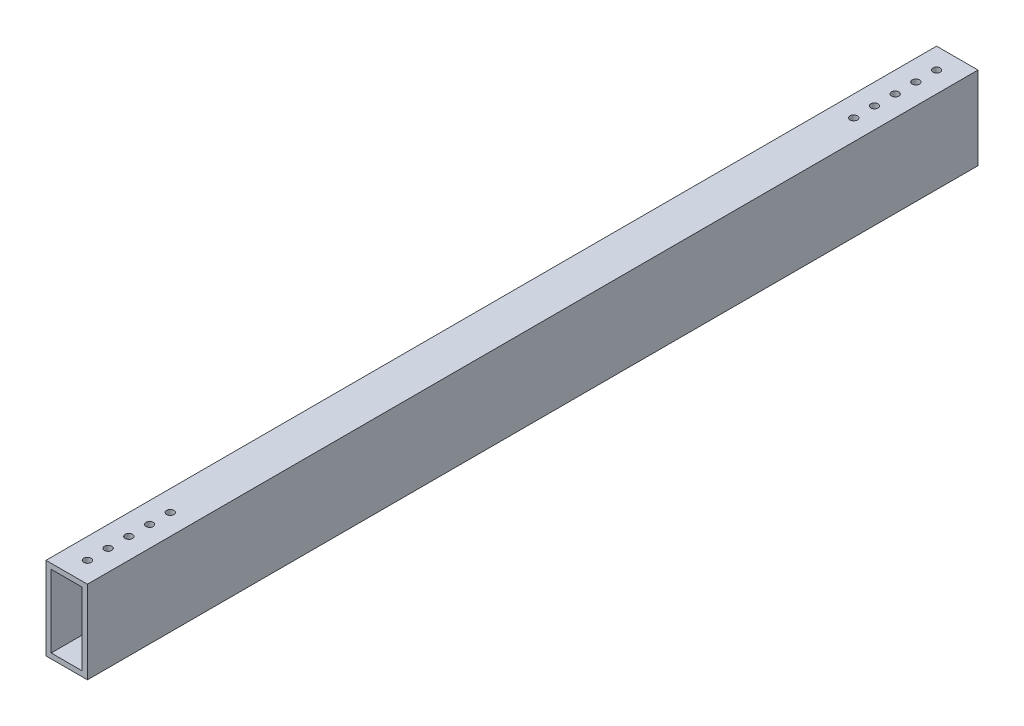
ISO-10303-21;
HEADER;
FILE_DESCRIPTION(('STEP AP214'),'2;1');
FILE_NAME('part.step','',(''),(''),'','','');
FILE_SCHEMA(('AUTOMOTIVE_DESIGN { 1 0 10303 214 1 1 1 1 }'));
ENDSEC;
DATA;
#1=APPLICATION_CONTEXT('core data for automotive mechanical design processes');
#2=APPLICATION_PROTOCOL_DEFINITION('international standard','automotive_design',2000,#1);
#3=PRODUCT_CONTEXT('',#1,'mechanical');
#4=PRODUCT('Part','Part','',(#3));
#5=PRODUCT_RELATED_PRODUCT_CATEGORY('part','',(#4));
#6=PRODUCT_DEFINITION_FORMATION('','',#4);
#7=PRODUCT_DEFINITION_CONTEXT('part definition',#1,'design');
#8=PRODUCT_DEFINITION('design','',#6,#7);
#9=PRODUCT_DEFINITION_SHAPE('','',#8);
#10=(LENGTH_UNIT() NAMED_UNIT(*) SI_UNIT(.MILLI.,.METRE.));
#11=(NAMED_UNIT(*) PLANE_ANGLE_UNIT() SI_UNIT($,.RADIAN.));
#12=(NAMED_UNIT(*) SI_UNIT($,.STERADIAN.) SOLID_ANGLE_UNIT());
#13=UNCERTAINTY_MEASURE_WITH_UNIT(LENGTH_MEASURE(1.E-05),#10,'distance_accuracy_value','');
#14=(GEOMETRIC_REPRESENTATION_CONTEXT(3) GLOBAL_UNCERTAINTY_ASSIGNED_CONTEXT((#13)) GLOBAL_UNIT_ASSIGNED_CONTEXT((#10,
#11,#12)) REPRESENTATION_CONTEXT('',''));
#15=CARTESIAN_POINT('',(0.,0.,0.));
#16=DIRECTION('',(0.,0.,1.));
#17=DIRECTION('',(1.,0.,0.));
#18=AXIS2_PLACEMENT_3D('',#15,#16,#17);
#19=CARTESIAN_POINT('',(0.,0.,273.05));
#20=DIRECTION('',(0.,0.,-1.));
#21=DIRECTION('',(-1.,0.,0.));
#22=AXIS2_PLACEMENT_3D('',#19,#20,#21);
#23=PLANE('',#22);
#24=DIRECTION('',(0.,-1.,0.));
#25=VECTOR('',#24,1.);
#26=CARTESIAN_POINT('',(0.,0.,273.05));
#27=LINE('',#26,#25);
#28=CARTESIAN_POINT('',(0.,50.8,273.05));
#29=VERTEX_POINT('',#28);
#30=CARTESIAN_POINT('',(0.,0.,273.05));
#31=VERTEX_POINT('',#30);
#32=EDGE_CURVE('E161',#29,#31,#27,.T.);
#33=ORIENTED_EDGE('',*,*,#32,.T.);
#34=DIRECTION('',(1.,0.,0.));
#35=VECTOR('',#34,1.);
#36=CARTESIAN_POINT('',(0.,0.,273.05));
#37=LINE('',#36,#35);
#38=CARTESIAN_POINT('',(25.4,0.,273.05));
#39=VERTEX_POINT('',#38);
#40=EDGE_CURVE('E165',#31,#39,#37,.T.);
#41=ORIENTED_EDGE('',*,*,#40,.T.);
#42=DIRECTION('',(0.,1.,0.));
#43=VECTOR('',#42,1.);
#44=CARTESIAN_POINT('',(25.4,0.,273.05));
#45=LINE('',#44,#43);
#46=CARTESIAN_POINT('',(25.4,50.8,273.05));
#47=VERTEX_POINT('',#46);
#48=EDGE_CURVE('E169',#39,#47,#45,.T.);
#49=ORIENTED_EDGE('',*,*,#48,.T.);
#50=DIRECTION('',(-1.,0.,0.));
#51=VECTOR('',#50,1.);
#52=CARTESIAN_POINT('',(0.,50.8,273.05));
#53=LINE('',#52,#51);
#54=EDGE_CURVE('E172',#47,#29,#53,.T.);
#55=ORIENTED_EDGE('',*,*,#54,.T.);
#56=EDGE_LOOP('',(#33,#41,#49,#55));
#57=FACE_BOUND('',#56,.T.);
#58=DIRECTION('',(0.,-1.,0.));
#59=VECTOR('',#58,1.);
#60=CARTESIAN_POINT('',(3.175,3.175,273.05));
#61=LINE('',#60,#59);
#62=CARTESIAN_POINT('',(3.175,47.625,273.05));
#63=VERTEX_POINT('',#62);
#64=CARTESIAN_POINT('',(3.175,3.175,273.05));
#65=VERTEX_POINT('',#64);
#66=EDGE_CURVE('E110',#63,#65,#61,.T.);
#67=ORIENTED_EDGE('',*,*,#66,.F.);
#68=DIRECTION('',(-1.,0.,0.));
#69=VECTOR('',#68,1.);
#70=CARTESIAN_POINT('',(3.175,47.625,273.05));
#71=LINE('',#70,#69);
#72=CARTESIAN_POINT('',(22.225,47.625,273.05));
#73=VERTEX_POINT('',#72);
#74=EDGE_CURVE('E137',#73,#63,#71,.T.);
#75=ORIENTED_EDGE('',*,*,#74,.F.);
#76=DIRECTION('',(0.,1.,0.));
#77=VECTOR('',#76,1.);
#78=CARTESIAN_POINT('',(22.225,3.175,273.05));
#79=LINE('',#78,#77);
#80=CARTESIAN_POINT('',(22.225,3.175,273.05));
#81=VERTEX_POINT('',#80);
#82=EDGE_CURVE('E132',#81,#73,#79,.T.);
#83=ORIENTED_EDGE('',*,*,#82,.F.);
#84=DIRECTION('',(1.,0.,0.));
#85=VECTOR('',#84,1.);
#86=CARTESIAN_POINT('',(3.175,3.175,273.05));
#87=LINE('',#86,#85);
#88=EDGE_CURVE('E119',#65,#81,#87,.T.);
#89=ORIENTED_EDGE('',*,*,#88,.F.);
#90=EDGE_LOOP('',(#67,#75,#83,#89));
#91=FACE_BOUND('',#90,.T.);
#92=ADVANCED_FACE('F42',(#57,#91),#23,.F.);
#93=CARTESIAN_POINT('',(0.,0.,-273.05));
#94=DIRECTION('',(0.,0.,-1.));
#95=DIRECTION('',(-1.,0.,0.));
#96=AXIS2_PLACEMENT_3D('',#93,#94,#95);
#97=PLANE('',#96);
#98=DIRECTION('',(0.,-1.,0.));
#99=VECTOR('',#98,1.);
#100=CARTESIAN_POINT('',(0.,0.,-273.05));
#101=LINE('',#100,#99);
#102=CARTESIAN_POINT('',(0.,50.8,-273.05));
#103=VERTEX_POINT('',#102);
#104=CARTESIAN_POINT('',(0.,0.,-273.05));
#105=VERTEX_POINT('',#104);
#106=EDGE_CURVE('E128',#103,#105,#101,.T.);
#107=ORIENTED_EDGE('',*,*,#106,.F.);
#108=DIRECTION('',(-1.,0.,0.));
#109=VECTOR('',#108,1.);
#110=CARTESIAN_POINT('',(0.,50.8,-273.05));
#111=LINE('',#110,#109);
#112=CARTESIAN_POINT('',(25.4,50.8,-273.05));
#113=VERTEX_POINT('',#112);
#114=EDGE_CURVE('E166',#113,#103,#111,.T.);
#115=ORIENTED_EDGE('',*,*,#114,.F.);
#116=DIRECTION('',(0.,1.,0.));
#117=VECTOR('',#116,1.);
#118=CARTESIAN_POINT('',(25.4,0.,-273.05));
#119=LINE('',#118,#117);
#120=CARTESIAN_POINT('',(25.4,0.,-273.05));
#121=VERTEX_POINT('',#120);
#122=EDGE_CURVE('E182',#121,#113,#119,.T.);
#123=ORIENTED_EDGE('',*,*,#122,.F.);
#124=DIRECTION('',(1.,0.,0.));
#125=VECTOR('',#124,1.);
#126=CARTESIAN_POINT('',(0.,0.,-273.05));
#127=LINE('',#126,#125);
#128=EDGE_CURVE('E179',#105,#121,#127,.T.);
#129=ORIENTED_EDGE('',*,*,#128,.F.);
#130=EDGE_LOOP('',(#107,#115,#123,#129));
#131=FACE_BOUND('',#130,.T.);
#132=DIRECTION('',(-1.,0.,0.));
#133=VECTOR('',#132,1.);
#134=CARTESIAN_POINT('',(3.175,47.625,-273.05));
#135=LINE('',#134,#133);
#136=CARTESIAN_POINT('',(22.225,47.625,-273.05));
#137=VERTEX_POINT('',#136);
#138=CARTESIAN_POINT('',(3.175,47.625,-273.05));
#139=VERTEX_POINT('',#138);
#140=EDGE_CURVE('E120',#137,#139,#135,.T.);
#141=ORIENTED_EDGE('',*,*,#140,.T.);
#142=DIRECTION('',(0.,-1.,0.));
#143=VECTOR('',#142,1.);
#144=CARTESIAN_POINT('',(3.175,3.175,-273.05));
#145=LINE('',#144,#143);
#146=CARTESIAN_POINT('',(3.175,3.175,-273.05));
#147=VERTEX_POINT('',#146);
#148=EDGE_CURVE('E68',#139,#147,#145,.T.);
#149=ORIENTED_EDGE('',*,*,#148,.T.);
#150=DIRECTION('',(1.,0.,0.));
#151=VECTOR('',#150,1.);
#152=CARTESIAN_POINT('',(3.175,3.175,-273.05));
#153=LINE('',#152,#151);
#154=CARTESIAN_POINT('',(22.225,3.175,-273.05));
#155=VERTEX_POINT('',#154);
#156=EDGE_CURVE('E126',#147,#155,#153,.T.);
#157=ORIENTED_EDGE('',*,*,#156,.T.);
#158=DIRECTION('',(0.,1.,0.));
#159=VECTOR('',#158,1.);
#160=CARTESIAN_POINT('',(22.225,3.175,-273.05));
#161=LINE('',#160,#159);
#162=EDGE_CURVE('E148',#155,#137,#161,.T.);
#163=ORIENTED_EDGE('',*,*,#162,.T.);
#164=EDGE_LOOP('',(#141,#149,#157,#163));
#165=FACE_BOUND('',#164,.T.);
#166=ADVANCED_FACE('F320',(#131,#165),#97,.T.);
#167=CARTESIAN_POINT('',(0.,0.,273.05));
#168=DIRECTION('',(1.,0.,0.));
#169=DIRECTION('',(0.,0.,-1.));
#170=AXIS2_PLACEMENT_3D('',#167,#168,#169);
#171=PLANE('',#170);
#172=ORIENTED_EDGE('',*,*,#106,.T.);
#173=DIRECTION('',(0.,0.,-1.));
#174=VECTOR('',#173,1.);
#175=CARTESIAN_POINT('',(0.,0.,273.05));
#176=LINE('',#175,#174);
#177=EDGE_CURVE('E11',#31,#105,#176,.T.);
#178=ORIENTED_EDGE('',*,*,#177,.F.);
#179=ORIENTED_EDGE('',*,*,#32,.F.);
#180=DIRECTION('',(0.,0.,-1.));
#181=VECTOR('',#180,1.);
#182=CARTESIAN_POINT('',(0.,50.8,273.05));
#183=LINE('',#182,#181);
#184=EDGE_CURVE('E175',#29,#103,#183,.T.);
#185=ORIENTED_EDGE('',*,*,#184,.T.);
#186=EDGE_LOOP('',(#172,#178,#179,#185));
#187=FACE_BOUND('',#186,.T.);
#188=ADVANCED_FACE('F44',(#187),#171,.F.);
#189=CARTESIAN_POINT('',(0.,0.,273.05));
#190=DIRECTION('',(0.,1.,0.));
#191=DIRECTION('',(0.,0.,1.));
#192=AXIS2_PLACEMENT_3D('',#189,#190,#191);
#193=PLANE('',#192);
#194=CARTESIAN_POINT('',(12.7,0.,260.35));
#195=DIRECTION('',(0.,-1.,0.));
#196=DIRECTION('',(0.,0.,-1.));
#197=AXIS2_PLACEMENT_3D('',#194,#195,#196);
#198=CIRCLE('',#197,2.24789999999998);
#199=CARTESIAN_POINT('',(12.7,0.,258.1021));
#200=VERTEX_POINT('',#199);
#201=EDGE_CURVE('E277',#200,#200,#198,.T.);
#202=ORIENTED_EDGE('',*,*,#201,.F.);
#203=EDGE_LOOP('',(#202));
#204=FACE_BOUND('',#203,.T.);
#205=CARTESIAN_POINT('',(12.7,0.,234.95));
#206=DIRECTION('',(0.,-1.,0.));
#207=DIRECTION('',(0.,0.,-1.));
#208=AXIS2_PLACEMENT_3D('',#205,#206,#207);
#209=CIRCLE('',#208,2.24789999999998);
#210=CARTESIAN_POINT('',(12.7,0.,232.7021));
#211=VERTEX_POINT('',#210);
#212=EDGE_CURVE('E255',#211,#211,#209,.T.);
#213=ORIENTED_EDGE('',*,*,#212,.F.);
#214=EDGE_LOOP('',(#213));
#215=FACE_BOUND('',#214,.T.);
#216=CARTESIAN_POINT('',(12.7,0.,209.55));
#217=DIRECTION('',(0.,-1.,0.));
#218=DIRECTION('',(0.,0.,-1.));
#219=AXIS2_PLACEMENT_3D('',#216,#217,#218);
#220=CIRCLE('',#219,2.24789999999998);
#221=CARTESIAN_POINT('',(12.7,0.,207.3021));
#222=VERTEX_POINT('',#221);
#223=EDGE_CURVE('E245',#222,#222,#220,.T.);
#224=ORIENTED_EDGE('',*,*,#223,.F.);
#225=EDGE_LOOP('',(#224));
#226=FACE_BOUND('',#225,.T.);
#227=CARTESIAN_POINT('',(12.7,0.,-260.35));
#228=DIRECTION('',(0.,1.,0.));
#229=DIRECTION('',(0.,0.,1.));
#230=AXIS2_PLACEMENT_3D('',#227,#228,#229);
#231=CIRCLE('',#230,2.24789999999998);
#232=CARTESIAN_POINT('',(12.7,0.,-258.1021));
#233=VERTEX_POINT('',#232);
#234=EDGE_CURVE('E278',#233,#233,#231,.T.);
#235=ORIENTED_EDGE('',*,*,#234,.T.);
#236=EDGE_LOOP('',(#235));
#237=FACE_BOUND('',#236,.T.);
#238=CARTESIAN_POINT('',(12.7,0.,-234.95));
#239=DIRECTION('',(0.,1.,0.));
#240=DIRECTION('',(0.,0.,1.));
#241=AXIS2_PLACEMENT_3D('',#238,#239,#240);
#242=CIRCLE('',#241,2.24789999999998);
#243=CARTESIAN_POINT('',(12.7,0.,-232.7021));
#244=VERTEX_POINT('',#243);
#245=EDGE_CURVE('E286',#244,#244,#242,.T.);
#246=ORIENTED_EDGE('',*,*,#245,.T.);
#247=EDGE_LOOP('',(#246));
#248=FACE_BOUND('',#247,.T.);
#249=CARTESIAN_POINT('',(12.7,0.,-209.55));
#250=DIRECTION('',(0.,1.,0.));
#251=DIRECTION('',(0.,0.,1.));
#252=AXIS2_PLACEMENT_3D('',#249,#250,#251);
#253=CIRCLE('',#252,2.24789999999998);
#254=CARTESIAN_POINT('',(12.7,0.,-207.3021));
#255=VERTEX_POINT('',#254);
#256=EDGE_CURVE('E218',#255,#255,#253,.T.);
#257=ORIENTED_EDGE('',*,*,#256,.T.);
#258=EDGE_LOOP('',(#257));
#259=FACE_BOUND('',#258,.T.);
#260=ORIENTED_EDGE('',*,*,#128,.T.);
#261=DIRECTION('',(0.,0.,-1.));
#262=VECTOR('',#261,1.);
#263=CARTESIAN_POINT('',(25.4,0.,273.05));
#264=LINE('',#263,#262);
#265=EDGE_CURVE('E52',#39,#121,#264,.T.);
#266=ORIENTED_EDGE('',*,*,#265,.F.);
#267=ORIENTED_EDGE('',*,*,#40,.F.);
#268=ORIENTED_EDGE('',*,*,#177,.T.);
#269=EDGE_LOOP('',(#260,#266,#267,#268));
#270=FACE_BOUND('',#269,.T.);
#271=ADVANCED_FACE('F334',(#204,#215,#226,#237,#248,#259,#270),#193,.F.);
#272=CARTESIAN_POINT('',(25.4,0.,273.05));
#273=DIRECTION('',(-1.,0.,0.));
#274=DIRECTION('',(0.,0.,1.));
#275=AXIS2_PLACEMENT_3D('',#272,#273,#274);
#276=PLANE('',#275);
#277=ORIENTED_EDGE('',*,*,#122,.T.);
#278=DIRECTION('',(0.,0.,-1.));
#279=VECTOR('',#278,1.);
#280=CARTESIAN_POINT('',(25.4,50.8,273.05));
#281=LINE('',#280,#279);
#282=EDGE_CURVE('E190',#47,#113,#281,.T.);
#283=ORIENTED_EDGE('',*,*,#282,.F.);
#284=ORIENTED_EDGE('',*,*,#48,.F.);
#285=ORIENTED_EDGE('',*,*,#265,.T.);
#286=EDGE_LOOP('',(#277,#283,#284,#285));
#287=FACE_BOUND('',#286,.T.);
#288=ADVANCED_FACE('F331',(#287),#276,.F.);
#289=CARTESIAN_POINT('',(0.,50.8,273.05));
#290=DIRECTION('',(0.,-1.,0.));
#291=DIRECTION('',(0.,0.,-1.));
#292=AXIS2_PLACEMENT_3D('',#289,#290,#291);
#293=PLANE('',#292);
#294=CARTESIAN_POINT('',(12.7,50.8,260.35));
#295=DIRECTION('',(0.,1.,0.));
#296=DIRECTION('',(0.,0.,1.));
#297=AXIS2_PLACEMENT_3D('',#294,#295,#296);
#298=CIRCLE('',#297,2.24789999999998);
#299=CARTESIAN_POINT('',(12.7,50.8,262.5979));
#300=VERTEX_POINT('',#299);
#301=EDGE_CURVE('E224',#300,#300,#298,.T.);
#302=ORIENTED_EDGE('',*,*,#301,.F.);
#303=EDGE_LOOP('',(#302));
#304=FACE_BOUND('',#303,.T.);
#305=CARTESIAN_POINT('',(12.7,50.8,247.65));
#306=DIRECTION('',(0.,1.,0.));
#307=DIRECTION('',(0.,0.,1.));
#308=AXIS2_PLACEMENT_3D('',#305,#306,#307);
#309=CIRCLE('',#308,2.24789999999998);
#310=CARTESIAN_POINT('',(12.7,50.8,249.8979));
#311=VERTEX_POINT('',#310);
#312=EDGE_CURVE('E441',#311,#311,#309,.T.);
#313=ORIENTED_EDGE('',*,*,#312,.F.);
#314=EDGE_LOOP('',(#313));
#315=FACE_BOUND('',#314,.T.);
#316=CARTESIAN_POINT('',(12.7,50.8,234.95));
#317=DIRECTION('',(0.,1.,0.));
#318=DIRECTION('',(0.,0.,1.));
#319=AXIS2_PLACEMENT_3D('',#316,#317,#318);
#320=CIRCLE('',#319,2.24789999999998);
#321=CARTESIAN_POINT('',(12.7,50.8,237.1979));
#322=VERTEX_POINT('',#321);
#323=EDGE_CURVE('E446',#322,#322,#320,.T.);
#324=ORIENTED_EDGE('',*,*,#323,.F.);
#325=EDGE_LOOP('',(#324));
#326=FACE_BOUND('',#325,.T.);
#327=CARTESIAN_POINT('',(12.7,50.8,222.25));
#328=DIRECTION('',(0.,1.,0.));
#329=DIRECTION('',(0.,0.,1.));
#330=AXIS2_PLACEMENT_3D('',#327,#328,#329);
#331=CIRCLE('',#330,2.24789999999998);
#332=CARTESIAN_POINT('',(12.7,50.8,224.4979));
#333=VERTEX_POINT('',#332);
#334=EDGE_CURVE('E452',#333,#333,#331,.T.);
#335=ORIENTED_EDGE('',*,*,#334,.F.);
#336=EDGE_LOOP('',(#335));
#337=FACE_BOUND('',#336,.T.);
#338=CARTESIAN_POINT('',(12.7,50.8,209.55));
#339=DIRECTION('',(0.,1.,0.));
#340=DIRECTION('',(0.,0.,1.));
#341=AXIS2_PLACEMENT_3D('',#338,#339,#340);
#342=CIRCLE('',#341,2.24789999999998);
#343=CARTESIAN_POINT('',(12.7,50.8,211.7979));
#344=VERTEX_POINT('',#343);
#345=EDGE_CURVE('E456',#344,#344,#342,.T.);
#346=ORIENTED_EDGE('',*,*,#345,.F.);
#347=EDGE_LOOP('',(#346));
#348=FACE_BOUND('',#347,.T.);
#349=CARTESIAN_POINT('',(12.7,50.8,-260.35));
#350=DIRECTION('',(0.,1.,0.));
#351=DIRECTION('',(0.,0.,1.));
#352=AXIS2_PLACEMENT_3D('',#349,#350,#351);
#353=CIRCLE('',#352,2.24789999999998);
#354=CARTESIAN_POINT('',(12.7,50.8,-258.1021));
#355=VERTEX_POINT('',#354);
#356=EDGE_CURVE('E202',#355,#355,#353,.T.);
#357=ORIENTED_EDGE('',*,*,#356,.F.);
#358=EDGE_LOOP('',(#357));
#359=FACE_BOUND('',#358,.T.);
#360=CARTESIAN_POINT('',(12.7,50.8,-247.65));
#361=DIRECTION('',(0.,1.,0.));
#362=DIRECTION('',(0.,0.,1.));
#363=AXIS2_PLACEMENT_3D('',#360,#361,#362);
#364=CIRCLE('',#363,2.24789999999998);
#365=CARTESIAN_POINT('',(12.7,50.8,-245.4021));
#366=VERTEX_POINT('',#365);
#367=EDGE_CURVE('E261',#366,#366,#364,.T.);
#368=ORIENTED_EDGE('',*,*,#367,.F.);
#369=EDGE_LOOP('',(#368));
#370=FACE_BOUND('',#369,.T.);
#371=CARTESIAN_POINT('',(12.7,50.8,-234.95));
#372=DIRECTION('',(0.,1.,0.));
#373=DIRECTION('',(0.,0.,1.));
#374=AXIS2_PLACEMENT_3D('',#371,#372,#373);
#375=CIRCLE('',#374,2.24789999999998);
#376=CARTESIAN_POINT('',(12.7,50.8,-232.7021));
#377=VERTEX_POINT('',#376);
#378=EDGE_CURVE('E265',#377,#377,#375,.T.);
#379=ORIENTED_EDGE('',*,*,#378,.F.);
#380=EDGE_LOOP('',(#379));
#381=FACE_BOUND('',#380,.T.);
#382=CARTESIAN_POINT('',(12.7,50.8,-222.25));
#383=DIRECTION('',(0.,1.,0.));
#384=DIRECTION('',(0.,0.,1.));
#385=AXIS2_PLACEMENT_3D('',#382,#383,#384);
#386=CIRCLE('',#385,2.24789999999998);
#387=CARTESIAN_POINT('',(12.7,50.8,-220.0021));
#388=VERTEX_POINT('',#387);
#389=EDGE_CURVE('E269',#388,#388,#386,.T.);
#390=ORIENTED_EDGE('',*,*,#389,.F.);
#391=EDGE_LOOP('',(#390));
#392=FACE_BOUND('',#391,.T.);
#393=CARTESIAN_POINT('',(12.7,50.8,-209.55));
#394=DIRECTION('',(0.,1.,0.));
#395=DIRECTION('',(0.,0.,1.));
#396=AXIS2_PLACEMENT_3D('',#393,#394,#395);
#397=CIRCLE('',#396,2.24789999999998);
#398=CARTESIAN_POINT('',(12.7,50.8,-207.3021));
#399=VERTEX_POINT('',#398);
#400=EDGE_CURVE('E273',#399,#399,#397,.T.);
#401=ORIENTED_EDGE('',*,*,#400,.F.);
#402=EDGE_LOOP('',(#401));
#403=FACE_BOUND('',#402,.T.);
#404=ORIENTED_EDGE('',*,*,#114,.T.);
#405=ORIENTED_EDGE('',*,*,#184,.F.);
#406=ORIENTED_EDGE('',*,*,#54,.F.);
#407=ORIENTED_EDGE('',*,*,#282,.T.);
#408=EDGE_LOOP('',(#404,#405,#406,#407));
#409=FACE_BOUND('',#408,.T.);
#410=ADVANCED_FACE('F315',(#304,#315,#326,#337,#348,#359,#370,#381,#392,#403,#409),#293,.F.);
#411=CARTESIAN_POINT('',(3.175,3.175,273.05));
#412=DIRECTION('',(1.,0.,0.));
#413=DIRECTION('',(0.,0.,-1.));
#414=AXIS2_PLACEMENT_3D('',#411,#412,#413);
#415=PLANE('',#414);
#416=ORIENTED_EDGE('',*,*,#148,.F.);
#417=DIRECTION('',(0.,0.,-1.));
#418=VECTOR('',#417,1.);
#419=CARTESIAN_POINT('',(3.175,47.625,273.05));
#420=LINE('',#419,#418);
#421=EDGE_CURVE('E114',#63,#139,#420,.T.);
#422=ORIENTED_EDGE('',*,*,#421,.F.);
#423=ORIENTED_EDGE('',*,*,#66,.T.);
#424=DIRECTION('',(0.,0.,-1.));
#425=VECTOR('',#424,1.);
#426=CARTESIAN_POINT('',(3.175,3.175,273.05));
#427=LINE('',#426,#425);
#428=EDGE_CURVE('E113',#65,#147,#427,.T.);
#429=ORIENTED_EDGE('',*,*,#428,.T.);
#430=EDGE_LOOP('',(#416,#422,#423,#429));
#431=FACE_BOUND('',#430,.T.);
#432=ADVANCED_FACE('F112',(#431),#415,.T.);
#433=CARTESIAN_POINT('',(3.175,3.175,273.05));
#434=DIRECTION('',(0.,1.,0.));
#435=DIRECTION('',(0.,0.,1.));
#436=AXIS2_PLACEMENT_3D('',#433,#434,#435);
#437=PLANE('',#436);
#438=CARTESIAN_POINT('',(12.7,3.175,260.35));
#439=DIRECTION('',(0.,1.,0.));
#440=DIRECTION('',(0.,0.,1.));
#441=AXIS2_PLACEMENT_3D('',#438,#439,#440);
#442=CIRCLE('',#441,2.24789999999998);
#443=CARTESIAN_POINT('',(12.7,3.175,262.5979));
#444=VERTEX_POINT('',#443);
#445=EDGE_CURVE('E460',#444,#444,#442,.F.);
#446=ORIENTED_EDGE('',*,*,#445,.T.);
#447=EDGE_LOOP('',(#446));
#448=FACE_BOUND('',#447,.T.);
#449=CARTESIAN_POINT('',(12.7,3.175,234.95));
#450=DIRECTION('',(0.,1.,0.));
#451=DIRECTION('',(0.,0.,1.));
#452=AXIS2_PLACEMENT_3D('',#449,#450,#451);
#453=CIRCLE('',#452,2.24789999999998);
#454=CARTESIAN_POINT('',(12.7,3.175,237.1979));
#455=VERTEX_POINT('',#454);
#456=EDGE_CURVE('E252',#455,#455,#453,.F.);
#457=ORIENTED_EDGE('',*,*,#456,.T.);
#458=EDGE_LOOP('',(#457));
#459=FACE_BOUND('',#458,.T.);
#460=CARTESIAN_POINT('',(12.7,3.175,209.55));
#461=DIRECTION('',(0.,1.,0.));
#462=DIRECTION('',(0.,0.,1.));
#463=AXIS2_PLACEMENT_3D('',#460,#461,#462);
#464=CIRCLE('',#463,2.24789999999998);
#465=CARTESIAN_POINT('',(12.7,3.175,211.7979));
#466=VERTEX_POINT('',#465);
#467=EDGE_CURVE('E239',#466,#466,#464,.F.);
#468=ORIENTED_EDGE('',*,*,#467,.T.);
#469=EDGE_LOOP('',(#468));
#470=FACE_BOUND('',#469,.T.);
#471=CARTESIAN_POINT('',(12.7,3.175,-260.35));
#472=DIRECTION('',(0.,1.,0.));
#473=DIRECTION('',(0.,0.,1.));
#474=AXIS2_PLACEMENT_3D('',#471,#472,#473);
#475=CIRCLE('',#474,2.24789999999998);
#476=CARTESIAN_POINT('',(12.7,3.175,-258.1021));
#477=VERTEX_POINT('',#476);
#478=EDGE_CURVE('E145',#477,#477,#475,.T.);
#479=ORIENTED_EDGE('',*,*,#478,.F.);
#480=EDGE_LOOP('',(#479));
#481=FACE_BOUND('',#480,.T.);
#482=CARTESIAN_POINT('',(12.7,3.175,-234.95));
#483=DIRECTION('',(0.,1.,0.));
#484=DIRECTION('',(0.,0.,1.));
#485=AXIS2_PLACEMENT_3D('',#482,#483,#484);
#486=CIRCLE('',#485,2.24789999999998);
#487=CARTESIAN_POINT('',(12.7,3.175,-232.7021));
#488=VERTEX_POINT('',#487);
#489=EDGE_CURVE('E282',#488,#488,#486,.T.);
#490=ORIENTED_EDGE('',*,*,#489,.F.);
#491=EDGE_LOOP('',(#490));
#492=FACE_BOUND('',#491,.T.);
#493=CARTESIAN_POINT('',(12.7,3.175,-209.55));
#494=DIRECTION('',(0.,1.,0.));
#495=DIRECTION('',(0.,0.,1.));
#496=AXIS2_PLACEMENT_3D('',#493,#494,#495);
#497=CIRCLE('',#496,2.24789999999998);
#498=CARTESIAN_POINT('',(12.7,3.175,-207.3021));
#499=VERTEX_POINT('',#498);
#500=EDGE_CURVE('E290',#499,#499,#497,.T.);
#501=ORIENTED_EDGE('',*,*,#500,.F.);
#502=EDGE_LOOP('',(#501));
#503=FACE_BOUND('',#502,.T.);
#504=ORIENTED_EDGE('',*,*,#156,.F.);
#505=ORIENTED_EDGE('',*,*,#428,.F.);
#506=ORIENTED_EDGE('',*,*,#88,.T.);
#507=DIRECTION('',(0.,0.,-1.));
#508=VECTOR('',#507,1.);
#509=CARTESIAN_POINT('',(22.225,3.175,273.05));
#510=LINE('',#509,#508);
#511=EDGE_CURVE('E129',#81,#155,#510,.T.);
#512=ORIENTED_EDGE('',*,*,#511,.T.);
#513=EDGE_LOOP('',(#504,#505,#506,#512));
#514=FACE_BOUND('',#513,.T.);
#515=ADVANCED_FACE('F123',(#448,#459,#470,#481,#492,#503,#514),#437,.T.);
#516=CARTESIAN_POINT('',(22.225,3.175,273.05));
#517=DIRECTION('',(-1.,0.,0.));
#518=DIRECTION('',(0.,0.,1.));
#519=AXIS2_PLACEMENT_3D('',#516,#517,#518);
#520=PLANE('',#519);
#521=ORIENTED_EDGE('',*,*,#162,.F.);
#522=ORIENTED_EDGE('',*,*,#511,.F.);
#523=ORIENTED_EDGE('',*,*,#82,.T.);
#524=DIRECTION('',(0.,0.,-1.));
#525=VECTOR('',#524,1.);
#526=CARTESIAN_POINT('',(22.225,47.625,273.05));
#527=LINE('',#526,#525);
#528=EDGE_CURVE('E60',#73,#137,#527,.T.);
#529=ORIENTED_EDGE('',*,*,#528,.T.);
#530=EDGE_LOOP('',(#521,#522,#523,#529));
#531=FACE_BOUND('',#530,.T.);
#532=ADVANCED_FACE('F305',(#531),#520,.T.);
#533=CARTESIAN_POINT('',(3.175,47.625,273.05));
#534=DIRECTION('',(0.,-1.,0.));
#535=DIRECTION('',(0.,0.,-1.));
#536=AXIS2_PLACEMENT_3D('',#533,#534,#535);
#537=PLANE('',#536);
#538=CARTESIAN_POINT('',(12.7,47.625,260.35));
#539=DIRECTION('',(0.,-1.,0.));
#540=DIRECTION('',(0.,0.,-1.));
#541=AXIS2_PLACEMENT_3D('',#538,#539,#540);
#542=CIRCLE('',#541,2.24789999999998);
#543=CARTESIAN_POINT('',(12.7,47.625,258.1021));
#544=VERTEX_POINT('',#543);
#545=EDGE_CURVE('E46',#544,#544,#542,.F.);
#546=ORIENTED_EDGE('',*,*,#545,.T.);
#547=EDGE_LOOP('',(#546));
#548=FACE_BOUND('',#547,.T.);
#549=CARTESIAN_POINT('',(12.7,47.625,247.65));
#550=DIRECTION('',(0.,-1.,0.));
#551=DIRECTION('',(0.,0.,-1.));
#552=AXIS2_PLACEMENT_3D('',#549,#550,#551);
#553=CIRCLE('',#552,2.24789999999998);
#554=CARTESIAN_POINT('',(12.7,47.625,245.4021));
#555=VERTEX_POINT('',#554);
#556=EDGE_CURVE('E231',#555,#555,#553,.F.);
#557=ORIENTED_EDGE('',*,*,#556,.T.);
#558=EDGE_LOOP('',(#557));
#559=FACE_BOUND('',#558,.T.);
#560=CARTESIAN_POINT('',(12.7,47.625,234.95));
#561=DIRECTION('',(0.,-1.,0.));
#562=DIRECTION('',(0.,0.,-1.));
#563=AXIS2_PLACEMENT_3D('',#560,#561,#562);
#564=CIRCLE('',#563,2.24789999999998);
#565=CARTESIAN_POINT('',(12.7,47.625,232.7021));
#566=VERTEX_POINT('',#565);
#567=EDGE_CURVE('E228',#566,#566,#564,.F.);
#568=ORIENTED_EDGE('',*,*,#567,.T.);
#569=EDGE_LOOP('',(#568));
#570=FACE_BOUND('',#569,.T.);
#571=CARTESIAN_POINT('',(12.7,47.625,222.25));
#572=DIRECTION('',(0.,-1.,0.));
#573=DIRECTION('',(0.,0.,-1.));
#574=AXIS2_PLACEMENT_3D('',#571,#572,#573);
#575=CIRCLE('',#574,2.24789999999998);
#576=CARTESIAN_POINT('',(12.7,47.625,220.0021));
#577=VERTEX_POINT('',#576);
#578=EDGE_CURVE('E223',#577,#577,#575,.F.);
#579=ORIENTED_EDGE('',*,*,#578,.T.);
#580=EDGE_LOOP('',(#579));
#581=FACE_BOUND('',#580,.T.);
#582=CARTESIAN_POINT('',(12.7,47.625,209.55));
#583=DIRECTION('',(0.,-1.,0.));
#584=DIRECTION('',(0.,0.,-1.));
#585=AXIS2_PLACEMENT_3D('',#582,#583,#584);
#586=CIRCLE('',#585,2.24789999999998);
#587=CARTESIAN_POINT('',(12.7,47.625,207.3021));
#588=VERTEX_POINT('',#587);
#589=EDGE_CURVE('E219',#588,#588,#586,.F.);
#590=ORIENTED_EDGE('',*,*,#589,.T.);
#591=EDGE_LOOP('',(#590));
#592=FACE_BOUND('',#591,.T.);
#593=CARTESIAN_POINT('',(12.7,47.625,-260.35));
#594=DIRECTION('',(0.,-1.,0.));
#595=DIRECTION('',(0.,0.,-1.));
#596=AXIS2_PLACEMENT_3D('',#593,#594,#595);
#597=CIRCLE('',#596,2.24789999999998);
#598=CARTESIAN_POINT('',(12.7,47.625,-262.5979));
#599=VERTEX_POINT('',#598);
#600=EDGE_CURVE('E214',#599,#599,#597,.F.);
#601=ORIENTED_EDGE('',*,*,#600,.T.);
#602=EDGE_LOOP('',(#601));
#603=FACE_BOUND('',#602,.T.);
#604=CARTESIAN_POINT('',(12.7,47.625,-247.65));
#605=DIRECTION('',(0.,-1.,0.));
#606=DIRECTION('',(0.,0.,-1.));
#607=AXIS2_PLACEMENT_3D('',#604,#605,#606);
#608=CIRCLE('',#607,2.24789999999998);
#609=CARTESIAN_POINT('',(12.7,47.625,-249.8979));
#610=VERTEX_POINT('',#609);
#611=EDGE_CURVE('E210',#610,#610,#608,.F.);
#612=ORIENTED_EDGE('',*,*,#611,.T.);
#613=EDGE_LOOP('',(#612));
#614=FACE_BOUND('',#613,.T.);
#615=CARTESIAN_POINT('',(12.7,47.625,-234.95));
#616=DIRECTION('',(0.,-1.,0.));
#617=DIRECTION('',(0.,0.,-1.));
#618=AXIS2_PLACEMENT_3D('',#615,#616,#617);
#619=CIRCLE('',#618,2.24789999999998);
#620=CARTESIAN_POINT('',(12.7,47.625,-237.1979));
#621=VERTEX_POINT('',#620);
#622=EDGE_CURVE('E206',#621,#621,#619,.F.);
#623=ORIENTED_EDGE('',*,*,#622,.T.);
#624=EDGE_LOOP('',(#623));
#625=FACE_BOUND('',#624,.T.);
#626=CARTESIAN_POINT('',(12.7,47.625,-222.25));
#627=DIRECTION('',(0.,-1.,0.));
#628=DIRECTION('',(0.,0.,-1.));
#629=AXIS2_PLACEMENT_3D('',#626,#627,#628);
#630=CIRCLE('',#629,2.24789999999998);
#631=CARTESIAN_POINT('',(12.7,47.625,-224.4979));
#632=VERTEX_POINT('',#631);
#633=EDGE_CURVE('E201',#632,#632,#630,.F.);
#634=ORIENTED_EDGE('',*,*,#633,.T.);
#635=EDGE_LOOP('',(#634));
#636=FACE_BOUND('',#635,.T.);
#637=CARTESIAN_POINT('',(12.7,47.625,-209.55));
#638=DIRECTION('',(0.,-1.,0.));
#639=DIRECTION('',(0.,0.,-1.));
#640=AXIS2_PLACEMENT_3D('',#637,#638,#639);
#641=CIRCLE('',#640,2.24789999999998);
#642=CARTESIAN_POINT('',(12.7,47.625,-211.7979));
#643=VERTEX_POINT('',#642);
#644=EDGE_CURVE('E197',#643,#643,#641,.F.);
#645=ORIENTED_EDGE('',*,*,#644,.T.);
#646=EDGE_LOOP('',(#645));
#647=FACE_BOUND('',#646,.T.);
#648=ORIENTED_EDGE('',*,*,#140,.F.);
#649=ORIENTED_EDGE('',*,*,#528,.F.);
#650=ORIENTED_EDGE('',*,*,#74,.T.);
#651=ORIENTED_EDGE('',*,*,#421,.T.);
#652=EDGE_LOOP('',(#648,#649,#650,#651));
#653=FACE_BOUND('',#652,.T.);
#654=ADVANCED_FACE('F312',(#548,#559,#570,#581,#592,#603,#614,#625,#636,#647,#653),#537,.T.);
#655=CARTESIAN_POINT('',(12.7,50.801,-209.55));
#656=DIRECTION('',(0.,-1.,0.));
#657=DIRECTION('',(0.,0.,-1.));
#658=AXIS2_PLACEMENT_3D('',#655,#656,#657);
#659=CYLINDRICAL_SURFACE('',#658,2.24789999999998);
#660=ORIENTED_EDGE('',*,*,#500,.T.);
#661=EDGE_LOOP('',(#660));
#662=FACE_BOUND('',#661,.T.);
#663=ORIENTED_EDGE('',*,*,#256,.F.);
#664=EDGE_LOOP('',(#663));
#665=FACE_BOUND('',#664,.T.);
#666=ADVANCED_FACE('F301',(#662,#665),#659,.F.);
#667=CARTESIAN_POINT('',(12.7,50.801,-234.95));
#668=DIRECTION('',(0.,-1.,0.));
#669=DIRECTION('',(0.,0.,-1.));
#670=AXIS2_PLACEMENT_3D('',#667,#668,#669);
#671=CYLINDRICAL_SURFACE('',#670,2.24789999999998);
#672=ORIENTED_EDGE('',*,*,#489,.T.);
#673=EDGE_LOOP('',(#672));
#674=FACE_BOUND('',#673,.T.);
#675=ORIENTED_EDGE('',*,*,#245,.F.);
#676=EDGE_LOOP('',(#675));
#677=FACE_BOUND('',#676,.T.);
#678=ADVANCED_FACE('F374',(#674,#677),#671,.F.);
#679=CARTESIAN_POINT('',(12.7,50.801,-260.35));
#680=DIRECTION('',(0.,-1.,0.));
#681=DIRECTION('',(0.,0.,-1.));
#682=AXIS2_PLACEMENT_3D('',#679,#680,#681);
#683=CYLINDRICAL_SURFACE('',#682,2.24789999999998);
#684=ORIENTED_EDGE('',*,*,#478,.T.);
#685=EDGE_LOOP('',(#684));
#686=FACE_BOUND('',#685,.T.);
#687=ORIENTED_EDGE('',*,*,#234,.F.);
#688=EDGE_LOOP('',(#687));
#689=FACE_BOUND('',#688,.T.);
#690=ADVANCED_FACE('F379',(#686,#689),#683,.F.);
#691=CARTESIAN_POINT('',(12.7,50.8,-209.55));
#692=DIRECTION('',(0.,-1.,0.));
#693=DIRECTION('',(0.,0.,-1.));
#694=AXIS2_PLACEMENT_3D('',#691,#692,#693);
#695=CYLINDRICAL_SURFACE('',#694,2.24789999999998);
#696=ORIENTED_EDGE('',*,*,#644,.F.);
#697=EDGE_LOOP('',(#696));
#698=FACE_BOUND('',#697,.T.);
#699=ORIENTED_EDGE('',*,*,#400,.T.);
#700=EDGE_LOOP('',(#699));
#701=FACE_BOUND('',#700,.T.);
#702=ADVANCED_FACE('F383',(#698,#701),#695,.F.);
#703=CARTESIAN_POINT('',(12.7,50.8,-222.25));
#704=DIRECTION('',(0.,-1.,0.));
#705=DIRECTION('',(0.,0.,-1.));
#706=AXIS2_PLACEMENT_3D('',#703,#704,#705);
#707=CYLINDRICAL_SURFACE('',#706,2.24789999999998);
#708=ORIENTED_EDGE('',*,*,#633,.F.);
#709=EDGE_LOOP('',(#708));
#710=FACE_BOUND('',#709,.T.);
#711=ORIENTED_EDGE('',*,*,#389,.T.);
#712=EDGE_LOOP('',(#711));
#713=FACE_BOUND('',#712,.T.);
#714=ADVANCED_FACE('F387',(#710,#713),#707,.F.);
#715=CARTESIAN_POINT('',(12.7,50.8,-234.95));
#716=DIRECTION('',(0.,-1.,0.));
#717=DIRECTION('',(0.,0.,-1.));
#718=AXIS2_PLACEMENT_3D('',#715,#716,#717);
#719=CYLINDRICAL_SURFACE('',#718,2.24789999999998);
#720=ORIENTED_EDGE('',*,*,#622,.F.);
#721=EDGE_LOOP('',(#720));
#722=FACE_BOUND('',#721,.T.);
#723=ORIENTED_EDGE('',*,*,#378,.T.);
#724=EDGE_LOOP('',(#723));
#725=FACE_BOUND('',#724,.T.);
#726=ADVANCED_FACE('F391',(#722,#725),#719,.F.);
#727=CARTESIAN_POINT('',(12.7,50.8,-247.65));
#728=DIRECTION('',(0.,-1.,0.));
#729=DIRECTION('',(0.,0.,-1.));
#730=AXIS2_PLACEMENT_3D('',#727,#728,#729);
#731=CYLINDRICAL_SURFACE('',#730,2.24789999999998);
#732=ORIENTED_EDGE('',*,*,#611,.F.);
#733=EDGE_LOOP('',(#732));
#734=FACE_BOUND('',#733,.T.);
#735=ORIENTED_EDGE('',*,*,#367,.T.);
#736=EDGE_LOOP('',(#735));
#737=FACE_BOUND('',#736,.T.);
#738=ADVANCED_FACE('F395',(#734,#737),#731,.F.);
#739=CARTESIAN_POINT('',(12.7,50.8,-260.35));
#740=DIRECTION('',(0.,-1.,0.));
#741=DIRECTION('',(0.,0.,-1.));
#742=AXIS2_PLACEMENT_3D('',#739,#740,#741);
#743=CYLINDRICAL_SURFACE('',#742,2.24789999999998);
#744=ORIENTED_EDGE('',*,*,#600,.F.);
#745=EDGE_LOOP('',(#744));
#746=FACE_BOUND('',#745,.T.);
#747=ORIENTED_EDGE('',*,*,#356,.T.);
#748=EDGE_LOOP('',(#747));
#749=FACE_BOUND('',#748,.T.);
#750=ADVANCED_FACE('F399',(#746,#749),#743,.F.);
#751=CARTESIAN_POINT('',(12.7,50.801,209.55));
#752=DIRECTION('',(0.,-1.,0.));
#753=DIRECTION('',(0.,0.,-1.));
#754=AXIS2_PLACEMENT_3D('',#751,#752,#753);
#755=CYLINDRICAL_SURFACE('',#754,2.24789999999998);
#756=ORIENTED_EDGE('',*,*,#467,.F.);
#757=EDGE_LOOP('',(#756));
#758=FACE_BOUND('',#757,.T.);
#759=ORIENTED_EDGE('',*,*,#223,.T.);
#760=EDGE_LOOP('',(#759));
#761=FACE_BOUND('',#760,.T.);
#762=ADVANCED_FACE('F403',(#758,#761),#755,.F.);
#763=CARTESIAN_POINT('',(12.7,50.801,234.95));
#764=DIRECTION('',(0.,-1.,0.));
#765=DIRECTION('',(0.,0.,-1.));
#766=AXIS2_PLACEMENT_3D('',#763,#764,#765);
#767=CYLINDRICAL_SURFACE('',#766,2.24789999999998);
#768=ORIENTED_EDGE('',*,*,#456,.F.);
#769=EDGE_LOOP('',(#768));
#770=FACE_BOUND('',#769,.T.);
#771=ORIENTED_EDGE('',*,*,#212,.T.);
#772=EDGE_LOOP('',(#771));
#773=FACE_BOUND('',#772,.T.);
#774=ADVANCED_FACE('F407',(#770,#773),#767,.F.);
#775=CARTESIAN_POINT('',(12.7,50.801,260.35));
#776=DIRECTION('',(0.,-1.,0.));
#777=DIRECTION('',(0.,0.,-1.));
#778=AXIS2_PLACEMENT_3D('',#775,#776,#777);
#779=CYLINDRICAL_SURFACE('',#778,2.24789999999998);
#780=ORIENTED_EDGE('',*,*,#445,.F.);
#781=EDGE_LOOP('',(#780));
#782=FACE_BOUND('',#781,.T.);
#783=ORIENTED_EDGE('',*,*,#201,.T.);
#784=EDGE_LOOP('',(#783));
#785=FACE_BOUND('',#784,.T.);
#786=ADVANCED_FACE('F411',(#782,#785),#779,.F.);
#787=CARTESIAN_POINT('',(12.7,50.8,209.55));
#788=DIRECTION('',(0.,-1.,0.));
#789=DIRECTION('',(0.,0.,-1.));
#790=AXIS2_PLACEMENT_3D('',#787,#788,#789);
#791=CYLINDRICAL_SURFACE('',#790,2.24789999999998);
#792=ORIENTED_EDGE('',*,*,#589,.F.);
#793=EDGE_LOOP('',(#792));
#794=FACE_BOUND('',#793,.T.);
#795=ORIENTED_EDGE('',*,*,#345,.T.);
#796=EDGE_LOOP('',(#795));
#797=FACE_BOUND('',#796,.T.);
#798=ADVANCED_FACE('F415',(#794,#797),#791,.F.);
#799=CARTESIAN_POINT('',(12.7,50.8,222.25));
#800=DIRECTION('',(0.,-1.,0.));
#801=DIRECTION('',(0.,0.,-1.));
#802=AXIS2_PLACEMENT_3D('',#799,#800,#801);
#803=CYLINDRICAL_SURFACE('',#802,2.24789999999998);
#804=ORIENTED_EDGE('',*,*,#578,.F.);
#805=EDGE_LOOP('',(#804));
#806=FACE_BOUND('',#805,.T.);
#807=ORIENTED_EDGE('',*,*,#334,.T.);
#808=EDGE_LOOP('',(#807));
#809=FACE_BOUND('',#808,.T.);
#810=ADVANCED_FACE('F419',(#806,#809),#803,.F.);
#811=CARTESIAN_POINT('',(12.7,50.8,234.95));
#812=DIRECTION('',(0.,-1.,0.));
#813=DIRECTION('',(0.,0.,-1.));
#814=AXIS2_PLACEMENT_3D('',#811,#812,#813);
#815=CYLINDRICAL_SURFACE('',#814,2.24789999999998);
#816=ORIENTED_EDGE('',*,*,#567,.F.);
#817=EDGE_LOOP('',(#816));
#818=FACE_BOUND('',#817,.T.);
#819=ORIENTED_EDGE('',*,*,#323,.T.);
#820=EDGE_LOOP('',(#819));
#821=FACE_BOUND('',#820,.T.);
#822=ADVANCED_FACE('F423',(#818,#821),#815,.F.);
#823=CARTESIAN_POINT('',(12.7,50.8,247.65));
#824=DIRECTION('',(0.,-1.,0.));
#825=DIRECTION('',(0.,0.,-1.));
#826=AXIS2_PLACEMENT_3D('',#823,#824,#825);
#827=CYLINDRICAL_SURFACE('',#826,2.24789999999998);
#828=ORIENTED_EDGE('',*,*,#556,.F.);
#829=EDGE_LOOP('',(#828));
#830=FACE_BOUND('',#829,.T.);
#831=ORIENTED_EDGE('',*,*,#312,.T.);
#832=EDGE_LOOP('',(#831));
#833=FACE_BOUND('',#832,.T.);
#834=ADVANCED_FACE('F427',(#830,#833),#827,.F.);
#835=CARTESIAN_POINT('',(12.7,50.8,260.35));
#836=DIRECTION('',(0.,-1.,0.));
#837=DIRECTION('',(0.,0.,-1.));
#838=AXIS2_PLACEMENT_3D('',#835,#836,#837);
#839=CYLINDRICAL_SURFACE('',#838,2.24789999999998);
#840=ORIENTED_EDGE('',*,*,#545,.F.);
#841=EDGE_LOOP('',(#840));
#842=FACE_BOUND('',#841,.T.);
#843=ORIENTED_EDGE('',*,*,#301,.T.);
#844=EDGE_LOOP('',(#843));
#845=FACE_BOUND('',#844,.T.);
#846=ADVANCED_FACE('F431',(#842,#845),#839,.F.);
#847=CLOSED_SHELL('',(#92,#166,#188,#271,#288,#410,#432,#515,#532,#654,#666,#678,#690,#702,#714,
#726,#738,#750,#762,#774,#786,#798,#810,#822,#834,#846));
#848=MANIFOLD_SOLID_BREP('B2',#847);
#849=ADVANCED_BREP_SHAPE_REPRESENTATION('',(#18,#848),#14);
#850=SHAPE_DEFINITION_REPRESENTATION(#9,#849);
ENDSEC;
END-ISO-10303-21;
